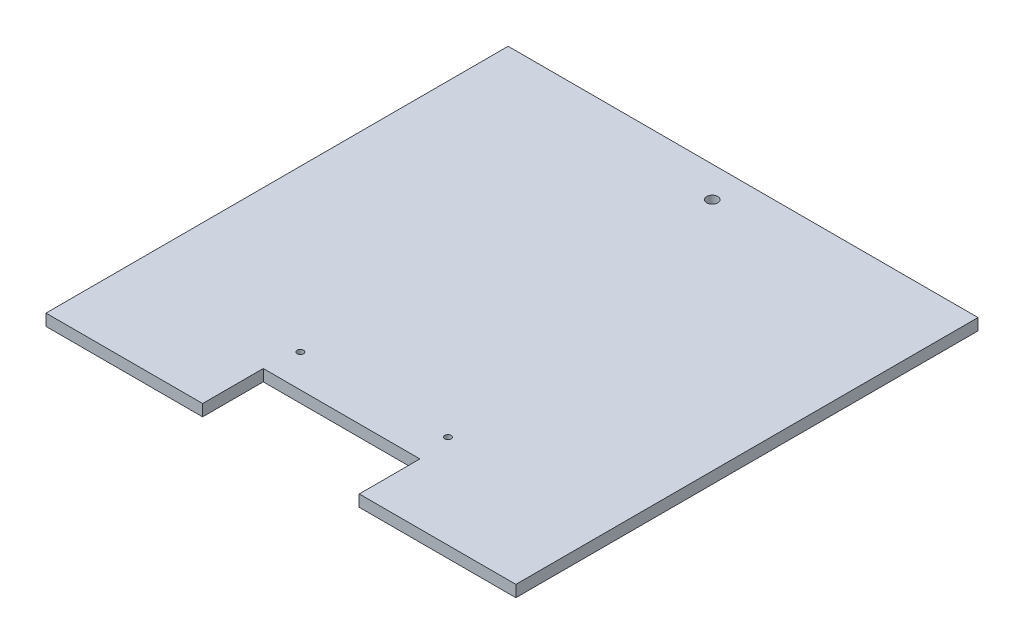
ISO-10303-21;
HEADER;
FILE_DESCRIPTION(('STEP AP214'),'2;1');
FILE_NAME('part.step','',(''),(''),'','','');
FILE_SCHEMA(('AUTOMOTIVE_DESIGN { 1 0 10303 214 1 1 1 1 }'));
ENDSEC;
DATA;
#1=APPLICATION_CONTEXT('core data for automotive mechanical design processes');
#2=APPLICATION_PROTOCOL_DEFINITION('international standard','automotive_design',2000,#1);
#3=PRODUCT_CONTEXT('',#1,'mechanical');
#4=PRODUCT('Part','Part','',(#3));
#5=PRODUCT_RELATED_PRODUCT_CATEGORY('part','',(#4));
#6=PRODUCT_DEFINITION_FORMATION('','',#4);
#7=PRODUCT_DEFINITION_CONTEXT('part definition',#1,'design');
#8=PRODUCT_DEFINITION('design','',#6,#7);
#9=PRODUCT_DEFINITION_SHAPE('','',#8);
#10=(LENGTH_UNIT() NAMED_UNIT(*) SI_UNIT(.MILLI.,.METRE.));
#11=(NAMED_UNIT(*) PLANE_ANGLE_UNIT() SI_UNIT($,.RADIAN.));
#12=(NAMED_UNIT(*) SI_UNIT($,.STERADIAN.) SOLID_ANGLE_UNIT());
#13=UNCERTAINTY_MEASURE_WITH_UNIT(LENGTH_MEASURE(1.E-05),#10,'distance_accuracy_value','');
#14=(GEOMETRIC_REPRESENTATION_CONTEXT(3) GLOBAL_UNCERTAINTY_ASSIGNED_CONTEXT((#13)) GLOBAL_UNIT_ASSIGNED_CONTEXT((#10,
#11,#12)) REPRESENTATION_CONTEXT('',''));
#15=CARTESIAN_POINT('',(0.,0.,0.));
#16=DIRECTION('',(0.,0.,1.));
#17=DIRECTION('',(1.,0.,0.));
#18=AXIS2_PLACEMENT_3D('',#15,#16,#17);
#19=CARTESIAN_POINT('',(-96.84,4.78,95.25));
#20=DIRECTION('',(0.,0.,-1.));
#21=DIRECTION('',(-1.,0.,0.));
#22=AXIS2_PLACEMENT_3D('',#19,#20,#21);
#23=PLANE('',#22);
#24=DIRECTION('',(1.,0.,0.));
#25=VECTOR('',#24,1.);
#26=CARTESIAN_POINT('',(-96.84,0.,95.25));
#27=LINE('',#26,#25);
#28=CARTESIAN_POINT('',(-96.84,0.,95.25));
#29=VERTEX_POINT('',#28);
#30=CARTESIAN_POINT('',(-32.28,0.,95.25));
#31=VERTEX_POINT('',#30);
#32=EDGE_CURVE('E128',#29,#31,#27,.T.);
#33=ORIENTED_EDGE('',*,*,#32,.T.);
#34=DIRECTION('',(0.,1.,0.));
#35=VECTOR('',#34,1.);
#36=CARTESIAN_POINT('',(-32.28,0.,95.25));
#37=LINE('',#36,#35);
#38=CARTESIAN_POINT('',(-32.28,4.78,95.25));
#39=VERTEX_POINT('',#38);
#40=EDGE_CURVE('E154',#31,#39,#37,.T.);
#41=ORIENTED_EDGE('',*,*,#40,.T.);
#42=DIRECTION('',(1.,0.,0.));
#43=VECTOR('',#42,1.);
#44=CARTESIAN_POINT('',(-96.84,4.78,95.25));
#45=LINE('',#44,#43);
#46=CARTESIAN_POINT('',(-96.84,4.78,95.25));
#47=VERTEX_POINT('',#46);
#48=EDGE_CURVE('E140',#47,#39,#45,.T.);
#49=ORIENTED_EDGE('',*,*,#48,.F.);
#50=DIRECTION('',(0.,-1.,0.));
#51=VECTOR('',#50,1.);
#52=CARTESIAN_POINT('',(-96.84,4.78,95.25));
#53=LINE('',#52,#51);
#54=EDGE_CURVE('E139',#47,#29,#53,.T.);
#55=ORIENTED_EDGE('',*,*,#54,.T.);
#56=EDGE_LOOP('',(#33,#41,#49,#55));
#57=FACE_BOUND('',#56,.T.);
#58=ADVANCED_FACE('F37',(#57),#23,.F.);
#59=CARTESIAN_POINT('',(96.84,4.78,95.25));
#60=DIRECTION('',(-1.,0.,0.));
#61=DIRECTION('',(0.,0.,1.));
#62=AXIS2_PLACEMENT_3D('',#59,#60,#61);
#63=PLANE('',#62);
#64=DIRECTION('',(0.,0.,-1.));
#65=VECTOR('',#64,1.);
#66=CARTESIAN_POINT('',(96.84,0.,95.25));
#67=LINE('',#66,#65);
#68=CARTESIAN_POINT('',(96.84,0.,95.25));
#69=VERTEX_POINT('',#68);
#70=CARTESIAN_POINT('',(96.84,0.,-95.25));
#71=VERTEX_POINT('',#70);
#72=EDGE_CURVE('E127',#69,#71,#67,.T.);
#73=ORIENTED_EDGE('',*,*,#72,.T.);
#74=DIRECTION('',(0.,-1.,0.));
#75=VECTOR('',#74,1.);
#76=CARTESIAN_POINT('',(96.84,4.78,-95.25));
#77=LINE('',#76,#75);
#78=CARTESIAN_POINT('',(96.84,4.78,-95.25));
#79=VERTEX_POINT('',#78);
#80=EDGE_CURVE('E11',#79,#71,#77,.T.);
#81=ORIENTED_EDGE('',*,*,#80,.F.);
#82=DIRECTION('',(0.,0.,-1.));
#83=VECTOR('',#82,1.);
#84=CARTESIAN_POINT('',(96.84,4.78,95.25));
#85=LINE('',#84,#83);
#86=CARTESIAN_POINT('',(96.84,4.78,95.25));
#87=VERTEX_POINT('',#86);
#88=EDGE_CURVE('E132',#87,#79,#85,.T.);
#89=ORIENTED_EDGE('',*,*,#88,.F.);
#90=DIRECTION('',(0.,-1.,0.));
#91=VECTOR('',#90,1.);
#92=CARTESIAN_POINT('',(96.84,4.78,95.25));
#93=LINE('',#92,#91);
#94=EDGE_CURVE('E137',#87,#69,#93,.T.);
#95=ORIENTED_EDGE('',*,*,#94,.T.);
#96=EDGE_LOOP('',(#73,#81,#89,#95));
#97=FACE_BOUND('',#96,.T.);
#98=ADVANCED_FACE('F39',(#97),#63,.F.);
#99=CARTESIAN_POINT('',(-96.84,4.78,-95.25));
#100=DIRECTION('',(0.,0.,1.));
#101=DIRECTION('',(1.,0.,0.));
#102=AXIS2_PLACEMENT_3D('',#99,#100,#101);
#103=PLANE('',#102);
#104=DIRECTION('',(-1.,0.,0.));
#105=VECTOR('',#104,1.);
#106=CARTESIAN_POINT('',(-96.84,0.,-95.25));
#107=LINE('',#106,#105);
#108=CARTESIAN_POINT('',(-96.84,0.,-95.25));
#109=VERTEX_POINT('',#108);
#110=EDGE_CURVE('E133',#71,#109,#107,.T.);
#111=ORIENTED_EDGE('',*,*,#110,.T.);
#112=DIRECTION('',(0.,-1.,0.));
#113=VECTOR('',#112,1.);
#114=CARTESIAN_POINT('',(-96.84,4.78,-95.25));
#115=LINE('',#114,#113);
#116=CARTESIAN_POINT('',(-96.84,4.78,-95.25));
#117=VERTEX_POINT('',#116);
#118=EDGE_CURVE('E45',#117,#109,#115,.T.);
#119=ORIENTED_EDGE('',*,*,#118,.F.);
#120=DIRECTION('',(-1.,0.,0.));
#121=VECTOR('',#120,1.);
#122=CARTESIAN_POINT('',(-96.84,4.78,-95.25));
#123=LINE('',#122,#121);
#124=EDGE_CURVE('E90',#79,#117,#123,.T.);
#125=ORIENTED_EDGE('',*,*,#124,.F.);
#126=ORIENTED_EDGE('',*,*,#80,.T.);
#127=EDGE_LOOP('',(#111,#119,#125,#126));
#128=FACE_BOUND('',#127,.T.);
#129=ADVANCED_FACE('F162',(#128),#103,.F.);
#130=CARTESIAN_POINT('',(-96.84,4.78,95.25));
#131=DIRECTION('',(1.,0.,0.));
#132=DIRECTION('',(0.,0.,-1.));
#133=AXIS2_PLACEMENT_3D('',#130,#131,#132);
#134=PLANE('',#133);
#135=DIRECTION('',(0.,0.,1.));
#136=VECTOR('',#135,1.);
#137=CARTESIAN_POINT('',(-96.84,0.,95.25));
#138=LINE('',#137,#136);
#139=EDGE_CURVE('E129',#109,#29,#138,.T.);
#140=ORIENTED_EDGE('',*,*,#139,.T.);
#141=ORIENTED_EDGE('',*,*,#54,.F.);
#142=DIRECTION('',(0.,0.,1.));
#143=VECTOR('',#142,1.);
#144=CARTESIAN_POINT('',(-96.84,4.78,95.25));
#145=LINE('',#144,#143);
#146=EDGE_CURVE('E148',#117,#47,#145,.T.);
#147=ORIENTED_EDGE('',*,*,#146,.F.);
#148=ORIENTED_EDGE('',*,*,#118,.T.);
#149=EDGE_LOOP('',(#140,#141,#147,#148));
#150=FACE_BOUND('',#149,.T.);
#151=ADVANCED_FACE('F146',(#150),#134,.F.);
#152=CARTESIAN_POINT('',(32.28,4.78,95.25));
#153=VERTEX_POINT('',#152);
#154=EDGE_CURVE('E61',#153,#87,#45,.T.);
#155=ORIENTED_EDGE('',*,*,#154,.F.);
#156=DIRECTION('',(0.,1.,0.));
#157=VECTOR('',#156,1.);
#158=CARTESIAN_POINT('',(32.28,0.,95.25));
#159=LINE('',#158,#157);
#160=CARTESIAN_POINT('',(32.28,0.,95.25));
#161=VERTEX_POINT('',#160);
#162=EDGE_CURVE('E114',#161,#153,#159,.T.);
#163=ORIENTED_EDGE('',*,*,#162,.F.);
#164=EDGE_CURVE('E83',#161,#69,#27,.T.);
#165=ORIENTED_EDGE('',*,*,#164,.T.);
#166=ORIENTED_EDGE('',*,*,#94,.F.);
#167=EDGE_LOOP('',(#155,#163,#165,#166));
#168=FACE_BOUND('',#167,.T.);
#169=ADVANCED_FACE('F119',(#168),#23,.F.);
#170=CARTESIAN_POINT('',(0.,4.78,0.));
#171=DIRECTION('',(0.,-1.,0.));
#172=DIRECTION('',(0.,0.,-1.));
#173=AXIS2_PLACEMENT_3D('',#170,#171,#172);
#174=PLANE('',#173);
#175=CARTESIAN_POINT('',(-30.511,4.78,56.699999962));
#176=DIRECTION('',(0.,1.,0.));
#177=DIRECTION('',(0.,0.,1.));
#178=AXIS2_PLACEMENT_3D('',#175,#176,#177);
#179=CIRCLE('',#178,1.29999999999996);
#180=CARTESIAN_POINT('',(-30.511,4.78,57.999999962));
#181=VERTEX_POINT('',#180);
#182=EDGE_CURVE('E192',#181,#181,#179,.T.);
#183=ORIENTED_EDGE('',*,*,#182,.F.);
#184=EDGE_LOOP('',(#183));
#185=FACE_BOUND('',#184,.T.);
#186=CARTESIAN_POINT('',(30.289,4.78,56.6999999620113));
#187=DIRECTION('',(0.,1.,0.));
#188=DIRECTION('',(0.,0.,1.));
#189=AXIS2_PLACEMENT_3D('',#186,#187,#188);
#190=CIRCLE('',#189,1.29999999999995);
#191=CARTESIAN_POINT('',(30.289,4.78,57.9999999620113));
#192=VERTEX_POINT('',#191);
#193=EDGE_CURVE('E189',#192,#192,#190,.T.);
#194=ORIENTED_EDGE('',*,*,#193,.F.);
#195=EDGE_LOOP('',(#194));
#196=FACE_BOUND('',#195,.T.);
#197=CARTESIAN_POINT('',(0.,4.78,-82.55));
#198=DIRECTION('',(0.,1.,0.));
#199=DIRECTION('',(0.,0.,1.));
#200=AXIS2_PLACEMENT_3D('',#197,#198,#199);
#201=CIRCLE('',#200,2.286);
#202=CARTESIAN_POINT('',(0.,4.78,-80.264));
#203=VERTEX_POINT('',#202);
#204=EDGE_CURVE('E168',#203,#203,#201,.T.);
#205=ORIENTED_EDGE('',*,*,#204,.F.);
#206=EDGE_LOOP('',(#205));
#207=FACE_BOUND('',#206,.T.);
#208=ORIENTED_EDGE('',*,*,#48,.T.);
#209=DIRECTION('',(0.,0.,1.));
#210=VECTOR('',#209,1.);
#211=CARTESIAN_POINT('',(-32.28,4.78,95.25));
#212=LINE('',#211,#210);
#213=CARTESIAN_POINT('',(-32.28,4.78,70.249999962));
#214=VERTEX_POINT('',#213);
#215=EDGE_CURVE('E117',#214,#39,#212,.T.);
#216=ORIENTED_EDGE('',*,*,#215,.F.);
#217=DIRECTION('',(-1.,0.,0.));
#218=VECTOR('',#217,1.);
#219=CARTESIAN_POINT('',(-32.28,4.78,70.249999962));
#220=LINE('',#219,#218);
#221=CARTESIAN_POINT('',(32.28,4.78,70.249999962));
#222=VERTEX_POINT('',#221);
#223=EDGE_CURVE('E178',#222,#214,#220,.T.);
#224=ORIENTED_EDGE('',*,*,#223,.F.);
#225=DIRECTION('',(0.,0.,-1.));
#226=VECTOR('',#225,1.);
#227=CARTESIAN_POINT('',(32.28,4.78,70.249999962));
#228=LINE('',#227,#226);
#229=EDGE_CURVE('E181',#153,#222,#228,.T.);
#230=ORIENTED_EDGE('',*,*,#229,.F.);
#231=ORIENTED_EDGE('',*,*,#154,.T.);
#232=ORIENTED_EDGE('',*,*,#88,.T.);
#233=ORIENTED_EDGE('',*,*,#124,.T.);
#234=ORIENTED_EDGE('',*,*,#146,.T.);
#235=EDGE_LOOP('',(#208,#216,#224,#230,#231,#232,#233,#234));
#236=FACE_BOUND('',#235,.T.);
#237=ADVANCED_FACE('F207',(#185,#196,#207,#236),#174,.F.);
#238=CARTESIAN_POINT('',(0.,0.,0.));
#239=DIRECTION('',(0.,-1.,0.));
#240=DIRECTION('',(0.,0.,-1.));
#241=AXIS2_PLACEMENT_3D('',#238,#239,#240);
#242=PLANE('',#241);
#243=CARTESIAN_POINT('',(-30.511,0.,56.699999962));
#244=DIRECTION('',(0.,1.,0.));
#245=DIRECTION('',(0.,0.,1.));
#246=AXIS2_PLACEMENT_3D('',#243,#244,#245);
#247=CIRCLE('',#246,1.29999999999996);
#248=CARTESIAN_POINT('',(-30.511,0.,57.999999962));
#249=VERTEX_POINT('',#248);
#250=EDGE_CURVE('E183',#249,#249,#247,.T.);
#251=ORIENTED_EDGE('',*,*,#250,.T.);
#252=EDGE_LOOP('',(#251));
#253=FACE_BOUND('',#252,.T.);
#254=CARTESIAN_POINT('',(30.289,0.,56.6999999620113));
#255=DIRECTION('',(0.,1.,0.));
#256=DIRECTION('',(0.,0.,1.));
#257=AXIS2_PLACEMENT_3D('',#254,#255,#256);
#258=CIRCLE('',#257,1.29999999999995);
#259=CARTESIAN_POINT('',(30.289,0.,57.9999999620113));
#260=VERTEX_POINT('',#259);
#261=EDGE_CURVE('E186',#260,#260,#258,.T.);
#262=ORIENTED_EDGE('',*,*,#261,.T.);
#263=EDGE_LOOP('',(#262));
#264=FACE_BOUND('',#263,.T.);
#265=DIRECTION('',(0.,0.,1.));
#266=VECTOR('',#265,1.);
#267=CARTESIAN_POINT('',(-32.28,0.,95.25));
#268=LINE('',#267,#266);
#269=CARTESIAN_POINT('',(-32.28,0.,70.249999962));
#270=VERTEX_POINT('',#269);
#271=EDGE_CURVE('E120',#270,#31,#268,.T.);
#272=ORIENTED_EDGE('',*,*,#271,.T.);
#273=ORIENTED_EDGE('',*,*,#32,.F.);
#274=ORIENTED_EDGE('',*,*,#139,.F.);
#275=ORIENTED_EDGE('',*,*,#110,.F.);
#276=ORIENTED_EDGE('',*,*,#72,.F.);
#277=ORIENTED_EDGE('',*,*,#164,.F.);
#278=DIRECTION('',(0.,0.,-1.));
#279=VECTOR('',#278,1.);
#280=CARTESIAN_POINT('',(32.28,0.,70.249999962));
#281=LINE('',#280,#279);
#282=CARTESIAN_POINT('',(32.28,0.,70.249999962));
#283=VERTEX_POINT('',#282);
#284=EDGE_CURVE('E111',#161,#283,#281,.T.);
#285=ORIENTED_EDGE('',*,*,#284,.T.);
#286=DIRECTION('',(-1.,0.,0.));
#287=VECTOR('',#286,1.);
#288=CARTESIAN_POINT('',(-32.28,0.,70.249999962));
#289=LINE('',#288,#287);
#290=EDGE_CURVE('E52',#283,#270,#289,.T.);
#291=ORIENTED_EDGE('',*,*,#290,.T.);
#292=EDGE_LOOP('',(#272,#273,#274,#275,#276,#277,#285,#291));
#293=FACE_BOUND('',#292,.T.);
#294=CARTESIAN_POINT('',(0.,0.,-82.55));
#295=DIRECTION('',(0.,1.,0.));
#296=DIRECTION('',(0.,0.,1.));
#297=AXIS2_PLACEMENT_3D('',#294,#295,#296);
#298=CIRCLE('',#297,2.286);
#299=CARTESIAN_POINT('',(0.,0.,-80.264));
#300=VERTEX_POINT('',#299);
#301=EDGE_CURVE('E161',#300,#300,#298,.T.);
#302=ORIENTED_EDGE('',*,*,#301,.T.);
#303=EDGE_LOOP('',(#302));
#304=FACE_BOUND('',#303,.T.);
#305=ADVANCED_FACE('F124',(#253,#264,#293,#304),#242,.T.);
#306=CARTESIAN_POINT('',(0.,0.,-82.55));
#307=DIRECTION('',(0.,1.,0.));
#308=DIRECTION('',(0.,0.,1.));
#309=AXIS2_PLACEMENT_3D('',#306,#307,#308);
#310=CYLINDRICAL_SURFACE('',#309,2.286);
#311=ORIENTED_EDGE('',*,*,#301,.F.);
#312=EDGE_LOOP('',(#311));
#313=FACE_BOUND('',#312,.T.);
#314=ORIENTED_EDGE('',*,*,#204,.T.);
#315=EDGE_LOOP('',(#314));
#316=FACE_BOUND('',#315,.T.);
#317=ADVANCED_FACE('F215',(#313,#316),#310,.F.);
#318=CARTESIAN_POINT('',(-32.28,0.,95.25));
#319=DIRECTION('',(-1.,0.,0.));
#320=DIRECTION('',(0.,0.,1.));
#321=AXIS2_PLACEMENT_3D('',#318,#319,#320);
#322=PLANE('',#321);
#323=ORIENTED_EDGE('',*,*,#215,.T.);
#324=ORIENTED_EDGE('',*,*,#40,.F.);
#325=ORIENTED_EDGE('',*,*,#271,.F.);
#326=DIRECTION('',(0.,1.,0.));
#327=VECTOR('',#326,1.);
#328=CARTESIAN_POINT('',(-32.28,0.,70.249999962));
#329=LINE('',#328,#327);
#330=EDGE_CURVE('E174',#270,#214,#329,.T.);
#331=ORIENTED_EDGE('',*,*,#330,.T.);
#332=EDGE_LOOP('',(#323,#324,#325,#331));
#333=FACE_BOUND('',#332,.T.);
#334=ADVANCED_FACE('F217',(#333),#322,.F.);
#335=CARTESIAN_POINT('',(-32.28,0.,70.249999962));
#336=DIRECTION('',(0.,0.,-1.));
#337=DIRECTION('',(-1.,0.,0.));
#338=AXIS2_PLACEMENT_3D('',#335,#336,#337);
#339=PLANE('',#338);
#340=ORIENTED_EDGE('',*,*,#223,.T.);
#341=ORIENTED_EDGE('',*,*,#330,.F.);
#342=ORIENTED_EDGE('',*,*,#290,.F.);
#343=DIRECTION('',(0.,1.,0.));
#344=VECTOR('',#343,1.);
#345=CARTESIAN_POINT('',(32.28,0.,70.249999962));
#346=LINE('',#345,#344);
#347=EDGE_CURVE('E115',#283,#222,#346,.T.);
#348=ORIENTED_EDGE('',*,*,#347,.T.);
#349=EDGE_LOOP('',(#340,#341,#342,#348));
#350=FACE_BOUND('',#349,.T.);
#351=ADVANCED_FACE('F224',(#350),#339,.F.);
#352=CARTESIAN_POINT('',(32.28,0.,70.249999962));
#353=DIRECTION('',(1.,0.,0.));
#354=DIRECTION('',(0.,0.,-1.));
#355=AXIS2_PLACEMENT_3D('',#352,#353,#354);
#356=PLANE('',#355);
#357=ORIENTED_EDGE('',*,*,#229,.T.);
#358=ORIENTED_EDGE('',*,*,#347,.F.);
#359=ORIENTED_EDGE('',*,*,#284,.F.);
#360=ORIENTED_EDGE('',*,*,#162,.T.);
#361=EDGE_LOOP('',(#357,#358,#359,#360));
#362=FACE_BOUND('',#361,.T.);
#363=ADVANCED_FACE('F113',(#362),#356,.F.);
#364=CARTESIAN_POINT('',(30.289,0.,56.6999999620113));
#365=DIRECTION('',(0.,1.,0.));
#366=DIRECTION('',(0.,0.,1.));
#367=AXIS2_PLACEMENT_3D('',#364,#365,#366);
#368=CYLINDRICAL_SURFACE('',#367,1.29999999999995);
#369=ORIENTED_EDGE('',*,*,#261,.F.);
#370=EDGE_LOOP('',(#369));
#371=FACE_BOUND('',#370,.T.);
#372=ORIENTED_EDGE('',*,*,#193,.T.);
#373=EDGE_LOOP('',(#372));
#374=FACE_BOUND('',#373,.T.);
#375=ADVANCED_FACE('F203',(#371,#374),#368,.F.);
#376=CARTESIAN_POINT('',(-30.511,0.,56.699999962));
#377=DIRECTION('',(0.,1.,0.));
#378=DIRECTION('',(0.,0.,1.));
#379=AXIS2_PLACEMENT_3D('',#376,#377,#378);
#380=CYLINDRICAL_SURFACE('',#379,1.29999999999996);
#381=ORIENTED_EDGE('',*,*,#250,.F.);
#382=EDGE_LOOP('',(#381));
#383=FACE_BOUND('',#382,.T.);
#384=ORIENTED_EDGE('',*,*,#182,.T.);
#385=EDGE_LOOP('',(#384));
#386=FACE_BOUND('',#385,.T.);
#387=ADVANCED_FACE('F200',(#383,#386),#380,.F.);
#388=CLOSED_SHELL('',(#58,#98,#129,#151,#169,#237,#305,#317,#334,#351,#363,#375,#387));
#389=MANIFOLD_SOLID_BREP('B2',#388);
#390=ADVANCED_BREP_SHAPE_REPRESENTATION('',(#18,#389),#14);
#391=SHAPE_DEFINITION_REPRESENTATION(#9,#390);
ENDSEC;
END-ISO-10303-21;
